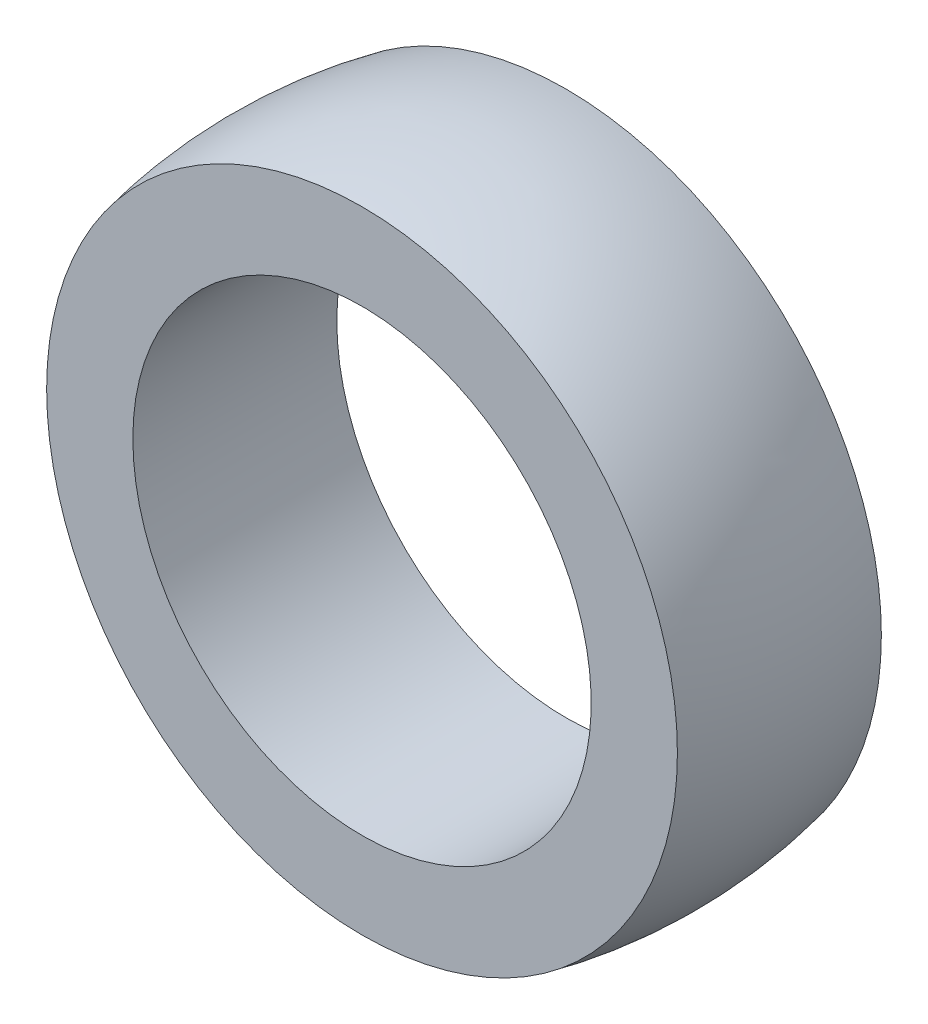
ISO-10303-21;
HEADER;
FILE_DESCRIPTION(('STEP AP214'),'2;1');
FILE_NAME('part.step','',(''),(''),'','','');
FILE_SCHEMA(('AUTOMOTIVE_DESIGN { 1 0 10303 214 1 1 1 1 }'));
ENDSEC;
DATA;
#1=APPLICATION_CONTEXT('core data for automotive mechanical design processes');
#2=APPLICATION_PROTOCOL_DEFINITION('international standard','automotive_design',2000,#1);
#3=PRODUCT_CONTEXT('',#1,'mechanical');
#4=PRODUCT('Part','Part','',(#3));
#5=PRODUCT_RELATED_PRODUCT_CATEGORY('part','',(#4));
#6=PRODUCT_DEFINITION_FORMATION('','',#4);
#7=PRODUCT_DEFINITION_CONTEXT('part definition',#1,'design');
#8=PRODUCT_DEFINITION('design','',#6,#7);
#9=PRODUCT_DEFINITION_SHAPE('','',#8);
#10=(LENGTH_UNIT() NAMED_UNIT(*) SI_UNIT(.MILLI.,.METRE.));
#11=(NAMED_UNIT(*) PLANE_ANGLE_UNIT() SI_UNIT($,.RADIAN.));
#12=(NAMED_UNIT(*) SI_UNIT($,.STERADIAN.) SOLID_ANGLE_UNIT());
#13=UNCERTAINTY_MEASURE_WITH_UNIT(LENGTH_MEASURE(1.E-05),#10,'distance_accuracy_value','');
#14=(GEOMETRIC_REPRESENTATION_CONTEXT(3) GLOBAL_UNCERTAINTY_ASSIGNED_CONTEXT((#13)) GLOBAL_UNIT_ASSIGNED_CONTEXT((#10,
#11,#12)) REPRESENTATION_CONTEXT('',''));
#15=CARTESIAN_POINT('',(0.,0.,0.));
#16=DIRECTION('',(0.,0.,1.));
#17=DIRECTION('',(1.,0.,0.));
#18=AXIS2_PLACEMENT_3D('',#15,#16,#17);
#19=CARTESIAN_POINT('',(0.,0.,0.));
#20=DIRECTION('',(0.,0.,-1.));
#21=DIRECTION('',(-1.,0.,0.));
#22=AXIS2_PLACEMENT_3D('',#19,#20,#21);
#23=DEGENERATE_TOROIDAL_SURFACE('',#22,21.01215,60.38215,.F.);
#24=CARTESIAN_POINT('',(0.,0.,12.319));
#25=DIRECTION('',(0.,0.,-1.));
#26=DIRECTION('',(-1.,0.,0.));
#27=AXIS2_PLACEMENT_3D('',#24,#25,#26);
#28=CIRCLE('',#27,38.1);
#29=CARTESIAN_POINT('',(-38.1,0.,12.319));
#30=VERTEX_POINT('',#29);
#31=EDGE_CURVE('E47',#30,#30,#28,.T.);
#32=ORIENTED_EDGE('',*,*,#31,.T.);
#33=EDGE_LOOP('',(#32));
#34=FACE_BOUND('',#33,.T.);
#35=CARTESIAN_POINT('',(0.,0.,-12.319));
#36=DIRECTION('',(0.,0.,-1.));
#37=DIRECTION('',(-1.,0.,0.));
#38=AXIS2_PLACEMENT_3D('',#35,#36,#37);
#39=CIRCLE('',#38,38.1);
#40=CARTESIAN_POINT('',(-38.1,0.,-12.319));
#41=VERTEX_POINT('',#40);
#42=EDGE_CURVE('E10',#41,#41,#39,.T.);
#43=ORIENTED_EDGE('',*,*,#42,.F.);
#44=EDGE_LOOP('',(#43));
#45=FACE_BOUND('',#44,.T.);
#46=ADVANCED_FACE('F33',(#34,#45),#23,.F.);
#47=CARTESIAN_POINT('',(0.,38.1,-12.319));
#48=DIRECTION('',(0.,0.,-1.));
#49=DIRECTION('',(-1.,0.,0.));
#50=AXIS2_PLACEMENT_3D('',#47,#48,#49);
#51=PLANE('',#50);
#52=ORIENTED_EDGE('',*,*,#42,.T.);
#53=EDGE_LOOP('',(#52));
#54=FACE_BOUND('',#53,.T.);
#55=CARTESIAN_POINT('',(0.,0.,-12.319));
#56=DIRECTION('',(0.,0.,-1.));
#57=DIRECTION('',(-1.,0.,0.));
#58=AXIS2_PLACEMENT_3D('',#55,#56,#57);
#59=CIRCLE('',#58,27.686);
#60=CARTESIAN_POINT('',(-27.686,0.,-12.319));
#61=VERTEX_POINT('',#60);
#62=EDGE_CURVE('E39',#61,#61,#59,.T.);
#63=ORIENTED_EDGE('',*,*,#62,.F.);
#64=EDGE_LOOP('',(#63));
#65=FACE_BOUND('',#64,.T.);
#66=ADVANCED_FACE('F63',(#54,#65),#51,.T.);
#67=CARTESIAN_POINT('',(0.,0.,0.));
#68=DIRECTION('',(0.,0.,-1.));
#69=DIRECTION('',(-1.,0.,0.));
#70=AXIS2_PLACEMENT_3D('',#67,#68,#69);
#71=CYLINDRICAL_SURFACE('',#70,27.686);
#72=ORIENTED_EDGE('',*,*,#62,.T.);
#73=EDGE_LOOP('',(#72));
#74=FACE_BOUND('',#73,.T.);
#75=CARTESIAN_POINT('',(0.,0.,12.319));
#76=DIRECTION('',(0.,0.,-1.));
#77=DIRECTION('',(-1.,0.,0.));
#78=AXIS2_PLACEMENT_3D('',#75,#76,#77);
#79=CIRCLE('',#78,27.686);
#80=CARTESIAN_POINT('',(-27.686,0.,12.319));
#81=VERTEX_POINT('',#80);
#82=EDGE_CURVE('E43',#81,#81,#79,.T.);
#83=ORIENTED_EDGE('',*,*,#82,.F.);
#84=EDGE_LOOP('',(#83));
#85=FACE_BOUND('',#84,.T.);
#86=ADVANCED_FACE('F57',(#74,#85),#71,.F.);
#87=CARTESIAN_POINT('',(0.,38.1,12.319));
#88=DIRECTION('',(0.,0.,1.));
#89=DIRECTION('',(1.,0.,0.));
#90=AXIS2_PLACEMENT_3D('',#87,#88,#89);
#91=PLANE('',#90);
#92=ORIENTED_EDGE('',*,*,#82,.T.);
#93=EDGE_LOOP('',(#92));
#94=FACE_BOUND('',#93,.T.);
#95=ORIENTED_EDGE('',*,*,#31,.F.);
#96=EDGE_LOOP('',(#95));
#97=FACE_BOUND('',#96,.T.);
#98=ADVANCED_FACE('F55',(#94,#97),#91,.T.);
#99=CLOSED_SHELL('',(#46,#66,#86,#98));
#100=MANIFOLD_SOLID_BREP('B2',#99);
#101=ADVANCED_BREP_SHAPE_REPRESENTATION('',(#18,#100),#14);
#102=SHAPE_DEFINITION_REPRESENTATION(#9,#101);
ENDSEC;
END-ISO-10303-21;
